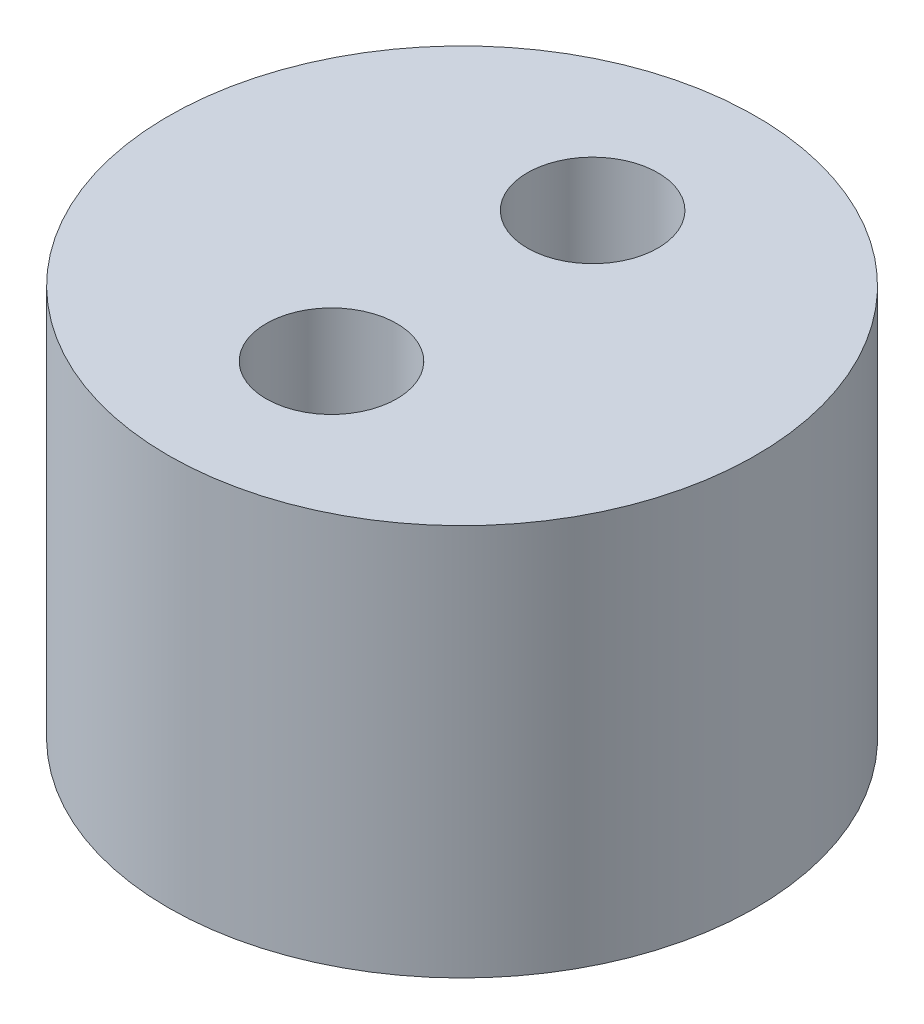
ISO-10303-21;
HEADER;
FILE_DESCRIPTION(('STEP AP214'),'2;1');
FILE_NAME('part.step','',(''),(''),'','','');
FILE_SCHEMA(('AUTOMOTIVE_DESIGN { 1 0 10303 214 1 1 1 1 }'));
ENDSEC;
DATA;
#1=APPLICATION_CONTEXT('core data for automotive mechanical design processes');
#2=APPLICATION_PROTOCOL_DEFINITION('international standard','automotive_design',2000,#1);
#3=PRODUCT_CONTEXT('',#1,'mechanical');
#4=PRODUCT('Part','Part','',(#3));
#5=PRODUCT_RELATED_PRODUCT_CATEGORY('part','',(#4));
#6=PRODUCT_DEFINITION_FORMATION('','',#4);
#7=PRODUCT_DEFINITION_CONTEXT('part definition',#1,'design');
#8=PRODUCT_DEFINITION('design','',#6,#7);
#9=PRODUCT_DEFINITION_SHAPE('','',#8);
#10=(LENGTH_UNIT() NAMED_UNIT(*) SI_UNIT(.MILLI.,.METRE.));
#11=(NAMED_UNIT(*) PLANE_ANGLE_UNIT() SI_UNIT($,.RADIAN.));
#12=(NAMED_UNIT(*) SI_UNIT($,.STERADIAN.) SOLID_ANGLE_UNIT());
#13=UNCERTAINTY_MEASURE_WITH_UNIT(LENGTH_MEASURE(1.E-05),#10,'distance_accuracy_value','');
#14=(GEOMETRIC_REPRESENTATION_CONTEXT(3) GLOBAL_UNCERTAINTY_ASSIGNED_CONTEXT((#13)) GLOBAL_UNIT_ASSIGNED_CONTEXT((#10,
#11,#12)) REPRESENTATION_CONTEXT('',''));
#15=CARTESIAN_POINT('',(0.,0.,0.));
#16=DIRECTION('',(0.,0.,1.));
#17=DIRECTION('',(1.,0.,0.));
#18=AXIS2_PLACEMENT_3D('',#15,#16,#17);
#19=CARTESIAN_POINT('',(0.,15.,0.));
#20=DIRECTION('',(0.,1.,0.));
#21=DIRECTION('',(0.,0.,1.));
#22=AXIS2_PLACEMENT_3D('',#19,#20,#21);
#23=PLANE('',#22);
#24=CARTESIAN_POINT('',(0.,15.,-5.));
#25=DIRECTION('',(0.,1.,0.));
#26=DIRECTION('',(0.,0.,1.));
#27=AXIS2_PLACEMENT_3D('',#24,#25,#26);
#28=CIRCLE('',#27,2.5);
#29=CARTESIAN_POINT('',(0.,15.,-2.5));
#30=VERTEX_POINT('',#29);
#31=EDGE_CURVE('E50',#30,#30,#28,.T.);
#32=ORIENTED_EDGE('',*,*,#31,.F.);
#33=EDGE_LOOP('',(#32));
#34=FACE_BOUND('',#33,.T.);
#35=CARTESIAN_POINT('',(0.,15.,0.));
#36=DIRECTION('',(0.,1.,0.));
#37=DIRECTION('',(0.,0.,1.));
#38=AXIS2_PLACEMENT_3D('',#35,#36,#37);
#39=CIRCLE('',#38,11.25);
#40=CARTESIAN_POINT('',(0.,15.,11.25));
#41=VERTEX_POINT('',#40);
#42=EDGE_CURVE('E10',#41,#41,#39,.T.);
#43=ORIENTED_EDGE('',*,*,#42,.T.);
#44=EDGE_LOOP('',(#43));
#45=FACE_BOUND('',#44,.T.);
#46=CARTESIAN_POINT('',(0.,15.,5.));
#47=DIRECTION('',(0.,1.,0.));
#48=DIRECTION('',(0.,0.,1.));
#49=AXIS2_PLACEMENT_3D('',#46,#47,#48);
#50=CIRCLE('',#49,2.5);
#51=CARTESIAN_POINT('',(0.,15.,7.5));
#52=VERTEX_POINT('',#51);
#53=EDGE_CURVE('E56',#52,#52,#50,.T.);
#54=ORIENTED_EDGE('',*,*,#53,.F.);
#55=EDGE_LOOP('',(#54));
#56=FACE_BOUND('',#55,.T.);
#57=ADVANCED_FACE('F37',(#34,#45,#56),#23,.T.);
#58=CARTESIAN_POINT('',(0.,0.,0.));
#59=DIRECTION('',(0.,1.,0.));
#60=DIRECTION('',(0.,0.,1.));
#61=AXIS2_PLACEMENT_3D('',#58,#59,#60);
#62=PLANE('',#61);
#63=CARTESIAN_POINT('',(0.,0.,0.));
#64=DIRECTION('',(0.,1.,0.));
#65=DIRECTION('',(0.,0.,1.));
#66=AXIS2_PLACEMENT_3D('',#63,#64,#65);
#67=CIRCLE('',#66,11.25);
#68=CARTESIAN_POINT('',(0.,0.,11.25));
#69=VERTEX_POINT('',#68);
#70=EDGE_CURVE('E41',#69,#69,#67,.T.);
#71=ORIENTED_EDGE('',*,*,#70,.F.);
#72=EDGE_LOOP('',(#71));
#73=FACE_BOUND('',#72,.T.);
#74=CARTESIAN_POINT('',(0.,0.,-5.));
#75=DIRECTION('',(0.,1.,0.));
#76=DIRECTION('',(0.,0.,1.));
#77=AXIS2_PLACEMENT_3D('',#74,#75,#76);
#78=CIRCLE('',#77,2.5);
#79=CARTESIAN_POINT('',(0.,0.,-2.5));
#80=VERTEX_POINT('',#79);
#81=EDGE_CURVE('E52',#80,#80,#78,.T.);
#82=ORIENTED_EDGE('',*,*,#81,.T.);
#83=EDGE_LOOP('',(#82));
#84=FACE_BOUND('',#83,.T.);
#85=CARTESIAN_POINT('',(0.,0.,5.));
#86=DIRECTION('',(0.,1.,0.));
#87=DIRECTION('',(0.,0.,1.));
#88=AXIS2_PLACEMENT_3D('',#85,#86,#87);
#89=CIRCLE('',#88,2.5);
#90=CARTESIAN_POINT('',(0.,0.,7.5));
#91=VERTEX_POINT('',#90);
#92=EDGE_CURVE('E60',#91,#91,#89,.T.);
#93=ORIENTED_EDGE('',*,*,#92,.T.);
#94=EDGE_LOOP('',(#93));
#95=FACE_BOUND('',#94,.T.);
#96=ADVANCED_FACE('F72',(#73,#84,#95),#62,.F.);
#97=CARTESIAN_POINT('',(0.,15.,0.));
#98=DIRECTION('',(0.,-1.,0.));
#99=DIRECTION('',(0.,0.,-1.));
#100=AXIS2_PLACEMENT_3D('',#97,#98,#99);
#101=CYLINDRICAL_SURFACE('',#100,11.25);
#102=ORIENTED_EDGE('',*,*,#42,.F.);
#103=EDGE_LOOP('',(#102));
#104=FACE_BOUND('',#103,.T.);
#105=ORIENTED_EDGE('',*,*,#70,.T.);
#106=EDGE_LOOP('',(#105));
#107=FACE_BOUND('',#106,.T.);
#108=ADVANCED_FACE('F39',(#104,#107),#101,.T.);
#109=CARTESIAN_POINT('',(0.,15.,-5.));
#110=DIRECTION('',(0.,-1.,0.));
#111=DIRECTION('',(0.,0.,-1.));
#112=AXIS2_PLACEMENT_3D('',#109,#110,#111);
#113=CYLINDRICAL_SURFACE('',#112,2.5);
#114=ORIENTED_EDGE('',*,*,#31,.T.);
#115=EDGE_LOOP('',(#114));
#116=FACE_BOUND('',#115,.T.);
#117=ORIENTED_EDGE('',*,*,#81,.F.);
#118=EDGE_LOOP('',(#117));
#119=FACE_BOUND('',#118,.T.);
#120=ADVANCED_FACE('F81',(#116,#119),#113,.F.);
#121=CARTESIAN_POINT('',(0.,15.,5.));
#122=DIRECTION('',(0.,-1.,0.));
#123=DIRECTION('',(0.,0.,-1.));
#124=AXIS2_PLACEMENT_3D('',#121,#122,#123);
#125=CYLINDRICAL_SURFACE('',#124,2.5);
#126=ORIENTED_EDGE('',*,*,#53,.T.);
#127=EDGE_LOOP('',(#126));
#128=FACE_BOUND('',#127,.T.);
#129=ORIENTED_EDGE('',*,*,#92,.F.);
#130=EDGE_LOOP('',(#129));
#131=FACE_BOUND('',#130,.T.);
#132=ADVANCED_FACE('F68',(#128,#131),#125,.F.);
#133=CLOSED_SHELL('',(#57,#96,#108,#120,#132));
#134=MANIFOLD_SOLID_BREP('B2',#133);
#135=ADVANCED_BREP_SHAPE_REPRESENTATION('',(#18,#134),#14);
#136=SHAPE_DEFINITION_REPRESENTATION(#9,#135);
ENDSEC;
END-ISO-10303-21;
